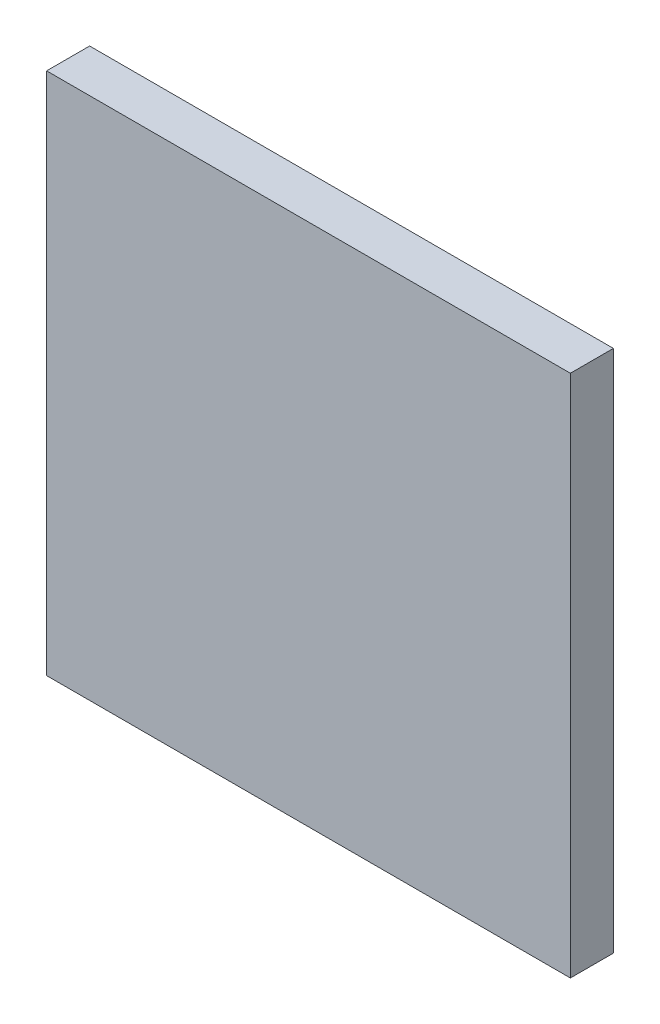
ISO-10303-21;
HEADER;
FILE_DESCRIPTION(('STEP AP214'),'2;1');
FILE_NAME('part.step','',(''),(''),'','','');
FILE_SCHEMA(('AUTOMOTIVE_DESIGN { 1 0 10303 214 1 1 1 1 }'));
ENDSEC;
DATA;
#1=APPLICATION_CONTEXT('core data for automotive mechanical design processes');
#2=APPLICATION_PROTOCOL_DEFINITION('international standard','automotive_design',2000,#1);
#3=PRODUCT_CONTEXT('',#1,'mechanical');
#4=PRODUCT('Part','Part','',(#3));
#5=PRODUCT_RELATED_PRODUCT_CATEGORY('part','',(#4));
#6=PRODUCT_DEFINITION_FORMATION('','',#4);
#7=PRODUCT_DEFINITION_CONTEXT('part definition',#1,'design');
#8=PRODUCT_DEFINITION('design','',#6,#7);
#9=PRODUCT_DEFINITION_SHAPE('','',#8);
#10=(LENGTH_UNIT() NAMED_UNIT(*) SI_UNIT(.MILLI.,.METRE.));
#11=(NAMED_UNIT(*) PLANE_ANGLE_UNIT() SI_UNIT($,.RADIAN.));
#12=(NAMED_UNIT(*) SI_UNIT($,.STERADIAN.) SOLID_ANGLE_UNIT());
#13=UNCERTAINTY_MEASURE_WITH_UNIT(LENGTH_MEASURE(1.E-05),#10,'distance_accuracy_value','');
#14=(GEOMETRIC_REPRESENTATION_CONTEXT(3) GLOBAL_UNCERTAINTY_ASSIGNED_CONTEXT((#13)) GLOBAL_UNIT_ASSIGNED_CONTEXT((#10,
#11,#12)) REPRESENTATION_CONTEXT('',''));
#15=CARTESIAN_POINT('',(0.,0.,0.));
#16=DIRECTION('',(0.,0.,1.));
#17=DIRECTION('',(1.,0.,0.));
#18=AXIS2_PLACEMENT_3D('',#15,#16,#17);
#19=CARTESIAN_POINT('',(7.00000124,-6.9999987,1.15000024));
#20=DIRECTION('',(0.,0.,1.));
#21=DIRECTION('',(1.,0.,0.));
#22=AXIS2_PLACEMENT_3D('',#19,#20,#21);
#23=PLANE('',#22);
#24=DIRECTION('',(0.,1.,0.));
#25=VECTOR('',#24,1.);
#26=CARTESIAN_POINT('',(-6.9999987,-6.9999987,1.15000024));
#27=LINE('',#26,#25);
#28=CARTESIAN_POINT('',(-6.9999987,-6.9999987,1.15000024));
#29=VERTEX_POINT('',#28);
#30=CARTESIAN_POINT('',(-6.9999987,7.00000124,1.15000024));
#31=VERTEX_POINT('',#30);
#32=EDGE_CURVE('E53',#29,#31,#27,.T.);
#33=ORIENTED_EDGE('',*,*,#32,.F.);
#34=DIRECTION('',(1.,0.,0.));
#35=VECTOR('',#34,1.);
#36=CARTESIAN_POINT('',(7.00000124,-6.9999987,1.15000024));
#37=LINE('',#36,#35);
#38=CARTESIAN_POINT('',(7.00000124,-6.9999987,1.15000024));
#39=VERTEX_POINT('',#38);
#40=EDGE_CURVE('E68',#39,#29,#37,.F.);
#41=ORIENTED_EDGE('',*,*,#40,.F.);
#42=DIRECTION('',(0.,1.,0.));
#43=VECTOR('',#42,1.);
#44=CARTESIAN_POINT('',(7.00000124,7.00000124,1.15000024));
#45=LINE('',#44,#43);
#46=CARTESIAN_POINT('',(7.00000124,7.00000124,1.15000024));
#47=VERTEX_POINT('',#46);
#48=EDGE_CURVE('E20',#47,#39,#45,.F.);
#49=ORIENTED_EDGE('',*,*,#48,.F.);
#50=DIRECTION('',(1.,0.,0.));
#51=VECTOR('',#50,1.);
#52=CARTESIAN_POINT('',(-6.9999987,7.00000124,1.15000024));
#53=LINE('',#52,#51);
#54=EDGE_CURVE('E58',#31,#47,#53,.T.);
#55=ORIENTED_EDGE('',*,*,#54,.F.);
#56=EDGE_LOOP('',(#33,#41,#49,#55));
#57=FACE_BOUND('',#56,.T.);
#58=ADVANCED_FACE('F17',(#57),#23,.T.);
#59=CARTESIAN_POINT('',(7.00000124,7.00000124,0.));
#60=DIRECTION('',(1.,0.,0.));
#61=DIRECTION('',(0.,0.,-1.));
#62=AXIS2_PLACEMENT_3D('',#59,#60,#61);
#63=PLANE('',#62);
#64=DIRECTION('',(0.,0.,-1.));
#65=VECTOR('',#64,1.);
#66=CARTESIAN_POINT('',(7.00000124,-6.9999987,0.));
#67=LINE('',#66,#65);
#68=CARTESIAN_POINT('',(7.00000124,-6.9999987,0.));
#69=VERTEX_POINT('',#68);
#70=EDGE_CURVE('E79',#69,#39,#67,.F.);
#71=ORIENTED_EDGE('',*,*,#70,.F.);
#72=DIRECTION('',(0.,1.,0.));
#73=VECTOR('',#72,1.);
#74=CARTESIAN_POINT('',(7.00000124,-6.9999987,0.));
#75=LINE('',#74,#73);
#76=CARTESIAN_POINT('',(7.00000124,7.00000124,0.));
#77=VERTEX_POINT('',#76);
#78=EDGE_CURVE('E74',#69,#77,#75,.T.);
#79=ORIENTED_EDGE('',*,*,#78,.T.);
#80=DIRECTION('',(0.,0.,1.));
#81=VECTOR('',#80,1.);
#82=CARTESIAN_POINT('',(7.00000124,7.00000124,0.));
#83=LINE('',#82,#81);
#84=EDGE_CURVE('E63',#47,#77,#83,.F.);
#85=ORIENTED_EDGE('',*,*,#84,.F.);
#86=ORIENTED_EDGE('',*,*,#48,.T.);
#87=EDGE_LOOP('',(#71,#79,#85,#86));
#88=FACE_BOUND('',#87,.T.);
#89=ADVANCED_FACE('F73',(#88),#63,.T.);
#90=CARTESIAN_POINT('',(-6.9999987,7.00000124,0.));
#91=DIRECTION('',(0.,1.,0.));
#92=DIRECTION('',(0.,0.,1.));
#93=AXIS2_PLACEMENT_3D('',#90,#91,#92);
#94=PLANE('',#93);
#95=ORIENTED_EDGE('',*,*,#84,.T.);
#96=DIRECTION('',(1.,0.,0.));
#97=VECTOR('',#96,1.);
#98=CARTESIAN_POINT('',(7.00000124,7.00000124,0.));
#99=LINE('',#98,#97);
#100=CARTESIAN_POINT('',(-6.9999987,7.00000124,0.));
#101=VERTEX_POINT('',#100);
#102=EDGE_CURVE('E84',#77,#101,#99,.F.);
#103=ORIENTED_EDGE('',*,*,#102,.T.);
#104=DIRECTION('',(0.,0.,1.));
#105=VECTOR('',#104,1.);
#106=CARTESIAN_POINT('',(-6.9999987,7.00000124,0.));
#107=LINE('',#106,#105);
#108=EDGE_CURVE('E65',#31,#101,#107,.F.);
#109=ORIENTED_EDGE('',*,*,#108,.F.);
#110=ORIENTED_EDGE('',*,*,#54,.T.);
#111=EDGE_LOOP('',(#95,#103,#109,#110));
#112=FACE_BOUND('',#111,.T.);
#113=ADVANCED_FACE('F60',(#112),#94,.T.);
#114=CARTESIAN_POINT('',(-6.9999987,-6.9999987,0.));
#115=DIRECTION('',(-1.,0.,0.));
#116=DIRECTION('',(0.,0.,1.));
#117=AXIS2_PLACEMENT_3D('',#114,#115,#116);
#118=PLANE('',#117);
#119=ORIENTED_EDGE('',*,*,#108,.T.);
#120=DIRECTION('',(0.,1.,0.));
#121=VECTOR('',#120,1.);
#122=CARTESIAN_POINT('',(-6.9999987,-6.9999987,0.));
#123=LINE('',#122,#121);
#124=CARTESIAN_POINT('',(-6.9999987,-6.9999987,0.));
#125=VERTEX_POINT('',#124);
#126=EDGE_CURVE('E26',#101,#125,#123,.F.);
#127=ORIENTED_EDGE('',*,*,#126,.T.);
#128=DIRECTION('',(0.,0.,-1.));
#129=VECTOR('',#128,1.);
#130=CARTESIAN_POINT('',(-6.9999987,-6.9999987,0.));
#131=LINE('',#130,#129);
#132=EDGE_CURVE('E34',#29,#125,#131,.T.);
#133=ORIENTED_EDGE('',*,*,#132,.F.);
#134=ORIENTED_EDGE('',*,*,#32,.T.);
#135=EDGE_LOOP('',(#119,#127,#133,#134));
#136=FACE_BOUND('',#135,.T.);
#137=ADVANCED_FACE('F88',(#136),#118,.T.);
#138=CARTESIAN_POINT('',(7.00000124,-6.9999987,0.));
#139=DIRECTION('',(0.,-1.,0.));
#140=DIRECTION('',(0.,0.,-1.));
#141=AXIS2_PLACEMENT_3D('',#138,#139,#140);
#142=PLANE('',#141);
#143=ORIENTED_EDGE('',*,*,#132,.T.);
#144=DIRECTION('',(1.,0.,0.));
#145=VECTOR('',#144,1.);
#146=CARTESIAN_POINT('',(7.00000124,-6.9999987,0.));
#147=LINE('',#146,#145);
#148=EDGE_CURVE('E11',#125,#69,#147,.T.);
#149=ORIENTED_EDGE('',*,*,#148,.T.);
#150=ORIENTED_EDGE('',*,*,#70,.T.);
#151=ORIENTED_EDGE('',*,*,#40,.T.);
#152=EDGE_LOOP('',(#143,#149,#150,#151));
#153=FACE_BOUND('',#152,.T.);
#154=ADVANCED_FACE('F91',(#153),#142,.T.);
#155=CARTESIAN_POINT('',(7.00000124,-6.9999987,0.));
#156=DIRECTION('',(0.,0.,1.));
#157=DIRECTION('',(1.,0.,0.));
#158=AXIS2_PLACEMENT_3D('',#155,#156,#157);
#159=PLANE('',#158);
#160=ORIENTED_EDGE('',*,*,#126,.F.);
#161=ORIENTED_EDGE('',*,*,#102,.F.);
#162=ORIENTED_EDGE('',*,*,#78,.F.);
#163=ORIENTED_EDGE('',*,*,#148,.F.);
#164=EDGE_LOOP('',(#160,#161,#162,#163));
#165=FACE_BOUND('',#164,.T.);
#166=ADVANCED_FACE('F90',(#165),#159,.F.);
#167=CLOSED_SHELL('',(#58,#89,#113,#137,#154,#166));
#168=MANIFOLD_SOLID_BREP('B1',#167);
#169=ADVANCED_BREP_SHAPE_REPRESENTATION('',(#18,#168),#14);
#170=SHAPE_DEFINITION_REPRESENTATION(#9,#169);
ENDSEC;
END-ISO-10303-21;
